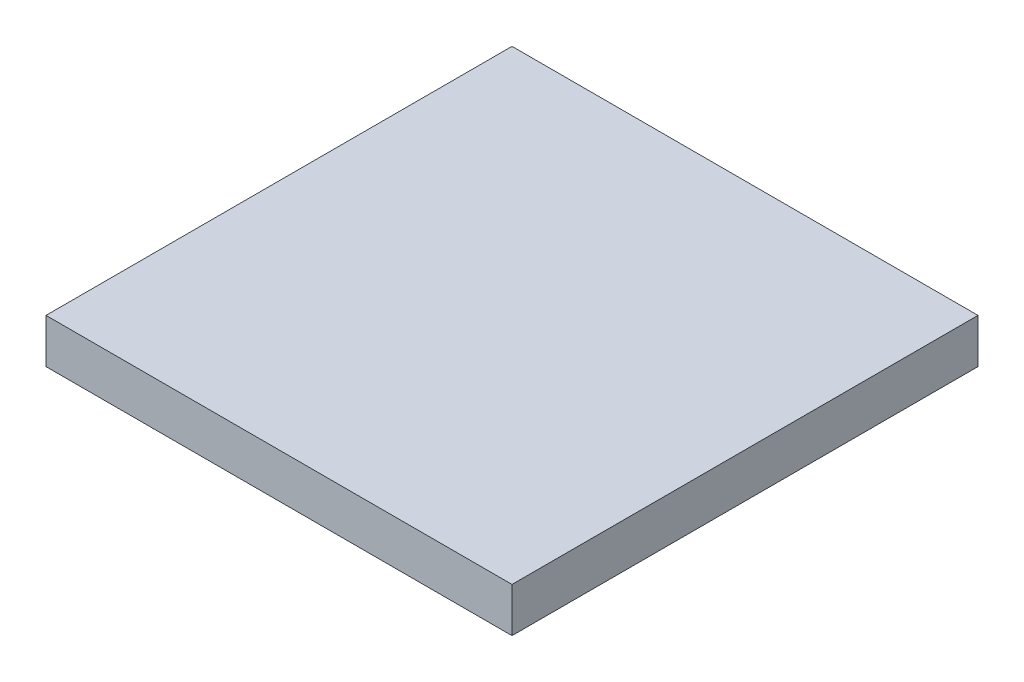
ISO-10303-21;
HEADER;
FILE_DESCRIPTION(('STEP AP214'),'2;1');
FILE_NAME('part.step','',(''),(''),'','','');
FILE_SCHEMA(('AUTOMOTIVE_DESIGN { 1 0 10303 214 1 1 1 1 }'));
ENDSEC;
DATA;
#1=APPLICATION_CONTEXT('core data for automotive mechanical design processes');
#2=APPLICATION_PROTOCOL_DEFINITION('international standard','automotive_design',2000,#1);
#3=PRODUCT_CONTEXT('',#1,'mechanical');
#4=PRODUCT('Part','Part','',(#3));
#5=PRODUCT_RELATED_PRODUCT_CATEGORY('part','',(#4));
#6=PRODUCT_DEFINITION_FORMATION('','',#4);
#7=PRODUCT_DEFINITION_CONTEXT('part definition',#1,'design');
#8=PRODUCT_DEFINITION('design','',#6,#7);
#9=PRODUCT_DEFINITION_SHAPE('','',#8);
#10=(LENGTH_UNIT() NAMED_UNIT(*) SI_UNIT(.MILLI.,.METRE.));
#11=(NAMED_UNIT(*) PLANE_ANGLE_UNIT() SI_UNIT($,.RADIAN.));
#12=(NAMED_UNIT(*) SI_UNIT($,.STERADIAN.) SOLID_ANGLE_UNIT());
#13=UNCERTAINTY_MEASURE_WITH_UNIT(LENGTH_MEASURE(1.E-05),#10,'distance_accuracy_value','');
#14=(GEOMETRIC_REPRESENTATION_CONTEXT(3) GLOBAL_UNCERTAINTY_ASSIGNED_CONTEXT((#13)) GLOBAL_UNIT_ASSIGNED_CONTEXT((#10,
#11,#12)) REPRESENTATION_CONTEXT('',''));
#15=CARTESIAN_POINT('',(0.,0.,0.));
#16=DIRECTION('',(0.,0.,1.));
#17=DIRECTION('',(1.,0.,0.));
#18=AXIS2_PLACEMENT_3D('',#15,#16,#17);
#19=CARTESIAN_POINT('',(-266.7,50.8,266.7));
#20=DIRECTION('',(1.,0.,0.));
#21=DIRECTION('',(0.,0.,-1.));
#22=AXIS2_PLACEMENT_3D('',#19,#20,#21);
#23=PLANE('',#22);
#24=DIRECTION('',(0.,0.,1.));
#25=VECTOR('',#24,1.);
#26=CARTESIAN_POINT('',(-266.7,0.,266.7));
#27=LINE('',#26,#25);
#28=CARTESIAN_POINT('',(-266.7,0.,-266.7));
#29=VERTEX_POINT('',#28);
#30=CARTESIAN_POINT('',(-266.7,0.,266.7));
#31=VERTEX_POINT('',#30);
#32=EDGE_CURVE('E96',#29,#31,#27,.T.);
#33=ORIENTED_EDGE('',*,*,#32,.T.);
#34=DIRECTION('',(0.,-1.,0.));
#35=VECTOR('',#34,1.);
#36=CARTESIAN_POINT('',(-266.7,50.8,266.7));
#37=LINE('',#36,#35);
#38=CARTESIAN_POINT('',(-266.7,50.8,266.7));
#39=VERTEX_POINT('',#38);
#40=EDGE_CURVE('E11',#39,#31,#37,.T.);
#41=ORIENTED_EDGE('',*,*,#40,.F.);
#42=DIRECTION('',(0.,0.,1.));
#43=VECTOR('',#42,1.);
#44=CARTESIAN_POINT('',(-266.7,50.8,266.7));
#45=LINE('',#44,#43);
#46=CARTESIAN_POINT('',(-266.7,50.8,-266.7));
#47=VERTEX_POINT('',#46);
#48=EDGE_CURVE('E84',#47,#39,#45,.T.);
#49=ORIENTED_EDGE('',*,*,#48,.F.);
#50=DIRECTION('',(0.,-1.,0.));
#51=VECTOR('',#50,1.);
#52=CARTESIAN_POINT('',(-266.7,50.8,-266.7));
#53=LINE('',#52,#51);
#54=EDGE_CURVE('E92',#47,#29,#53,.T.);
#55=ORIENTED_EDGE('',*,*,#54,.T.);
#56=EDGE_LOOP('',(#33,#41,#49,#55));
#57=FACE_BOUND('',#56,.T.);
#58=ADVANCED_FACE('F33',(#57),#23,.F.);
#59=CARTESIAN_POINT('',(266.7,50.8,266.7));
#60=DIRECTION('',(0.,0.,-1.));
#61=DIRECTION('',(-1.,0.,0.));
#62=AXIS2_PLACEMENT_3D('',#59,#60,#61);
#63=PLANE('',#62);
#64=DIRECTION('',(1.,0.,0.));
#65=VECTOR('',#64,1.);
#66=CARTESIAN_POINT('',(266.7,0.,266.7));
#67=LINE('',#66,#65);
#68=CARTESIAN_POINT('',(266.7,0.,266.7));
#69=VERTEX_POINT('',#68);
#70=EDGE_CURVE('E88',#31,#69,#67,.T.);
#71=ORIENTED_EDGE('',*,*,#70,.T.);
#72=DIRECTION('',(0.,-1.,0.));
#73=VECTOR('',#72,1.);
#74=CARTESIAN_POINT('',(266.7,50.8,266.7));
#75=LINE('',#74,#73);
#76=CARTESIAN_POINT('',(266.7,50.8,266.7));
#77=VERTEX_POINT('',#76);
#78=EDGE_CURVE('E41',#77,#69,#75,.T.);
#79=ORIENTED_EDGE('',*,*,#78,.F.);
#80=DIRECTION('',(1.,0.,0.));
#81=VECTOR('',#80,1.);
#82=CARTESIAN_POINT('',(266.7,50.8,266.7));
#83=LINE('',#82,#81);
#84=EDGE_CURVE('E79',#39,#77,#83,.T.);
#85=ORIENTED_EDGE('',*,*,#84,.F.);
#86=ORIENTED_EDGE('',*,*,#40,.T.);
#87=EDGE_LOOP('',(#71,#79,#85,#86));
#88=FACE_BOUND('',#87,.T.);
#89=ADVANCED_FACE('F87',(#88),#63,.F.);
#90=CARTESIAN_POINT('',(266.7,50.8,266.7));
#91=DIRECTION('',(-1.,0.,0.));
#92=DIRECTION('',(0.,0.,1.));
#93=AXIS2_PLACEMENT_3D('',#90,#91,#92);
#94=PLANE('',#93);
#95=DIRECTION('',(0.,0.,-1.));
#96=VECTOR('',#95,1.);
#97=CARTESIAN_POINT('',(266.7,0.,266.7));
#98=LINE('',#97,#96);
#99=CARTESIAN_POINT('',(266.7,0.,-266.7));
#100=VERTEX_POINT('',#99);
#101=EDGE_CURVE('E66',#69,#100,#98,.T.);
#102=ORIENTED_EDGE('',*,*,#101,.T.);
#103=DIRECTION('',(0.,-1.,0.));
#104=VECTOR('',#103,1.);
#105=CARTESIAN_POINT('',(266.7,50.8,-266.7));
#106=LINE('',#105,#104);
#107=CARTESIAN_POINT('',(266.7,50.8,-266.7));
#108=VERTEX_POINT('',#107);
#109=EDGE_CURVE('E89',#108,#100,#106,.T.);
#110=ORIENTED_EDGE('',*,*,#109,.F.);
#111=DIRECTION('',(0.,0.,-1.));
#112=VECTOR('',#111,1.);
#113=CARTESIAN_POINT('',(266.7,50.8,266.7));
#114=LINE('',#113,#112);
#115=EDGE_CURVE('E82',#77,#108,#114,.T.);
#116=ORIENTED_EDGE('',*,*,#115,.F.);
#117=ORIENTED_EDGE('',*,*,#78,.T.);
#118=EDGE_LOOP('',(#102,#110,#116,#117));
#119=FACE_BOUND('',#118,.T.);
#120=ADVANCED_FACE('F90',(#119),#94,.F.);
#121=CARTESIAN_POINT('',(266.7,50.8,-266.7));
#122=DIRECTION('',(0.,0.,1.));
#123=DIRECTION('',(1.,0.,0.));
#124=AXIS2_PLACEMENT_3D('',#121,#122,#123);
#125=PLANE('',#124);
#126=DIRECTION('',(-1.,0.,0.));
#127=VECTOR('',#126,1.);
#128=CARTESIAN_POINT('',(266.7,0.,-266.7));
#129=LINE('',#128,#127);
#130=EDGE_CURVE('E72',#100,#29,#129,.T.);
#131=ORIENTED_EDGE('',*,*,#130,.T.);
#132=ORIENTED_EDGE('',*,*,#54,.F.);
#133=DIRECTION('',(-1.,0.,0.));
#134=VECTOR('',#133,1.);
#135=CARTESIAN_POINT('',(266.7,50.8,-266.7));
#136=LINE('',#135,#134);
#137=EDGE_CURVE('E49',#108,#47,#136,.T.);
#138=ORIENTED_EDGE('',*,*,#137,.F.);
#139=ORIENTED_EDGE('',*,*,#109,.T.);
#140=EDGE_LOOP('',(#131,#132,#138,#139));
#141=FACE_BOUND('',#140,.T.);
#142=ADVANCED_FACE('F103',(#141),#125,.F.);
#143=CARTESIAN_POINT('',(0.,50.8,0.));
#144=DIRECTION('',(0.,1.,0.));
#145=DIRECTION('',(0.,0.,1.));
#146=AXIS2_PLACEMENT_3D('',#143,#144,#145);
#147=PLANE('',#146);
#148=ORIENTED_EDGE('',*,*,#48,.T.);
#149=ORIENTED_EDGE('',*,*,#84,.T.);
#150=ORIENTED_EDGE('',*,*,#115,.T.);
#151=ORIENTED_EDGE('',*,*,#137,.T.);
#152=EDGE_LOOP('',(#148,#149,#150,#151));
#153=FACE_BOUND('',#152,.T.);
#154=ADVANCED_FACE('F80',(#153),#147,.T.);
#155=CARTESIAN_POINT('',(0.,0.,0.));
#156=DIRECTION('',(0.,1.,0.));
#157=DIRECTION('',(0.,0.,1.));
#158=AXIS2_PLACEMENT_3D('',#155,#156,#157);
#159=PLANE('',#158);
#160=ORIENTED_EDGE('',*,*,#32,.F.);
#161=ORIENTED_EDGE('',*,*,#130,.F.);
#162=ORIENTED_EDGE('',*,*,#101,.F.);
#163=ORIENTED_EDGE('',*,*,#70,.F.);
#164=EDGE_LOOP('',(#160,#161,#162,#163));
#165=FACE_BOUND('',#164,.T.);
#166=ADVANCED_FACE('F106',(#165),#159,.F.);
#167=CLOSED_SHELL('',(#58,#89,#120,#142,#154,#166));
#168=MANIFOLD_SOLID_BREP('B2',#167);
#169=ADVANCED_BREP_SHAPE_REPRESENTATION('',(#18,#168),#14);
#170=SHAPE_DEFINITION_REPRESENTATION(#9,#169);
ENDSEC;
END-ISO-10303-21;
